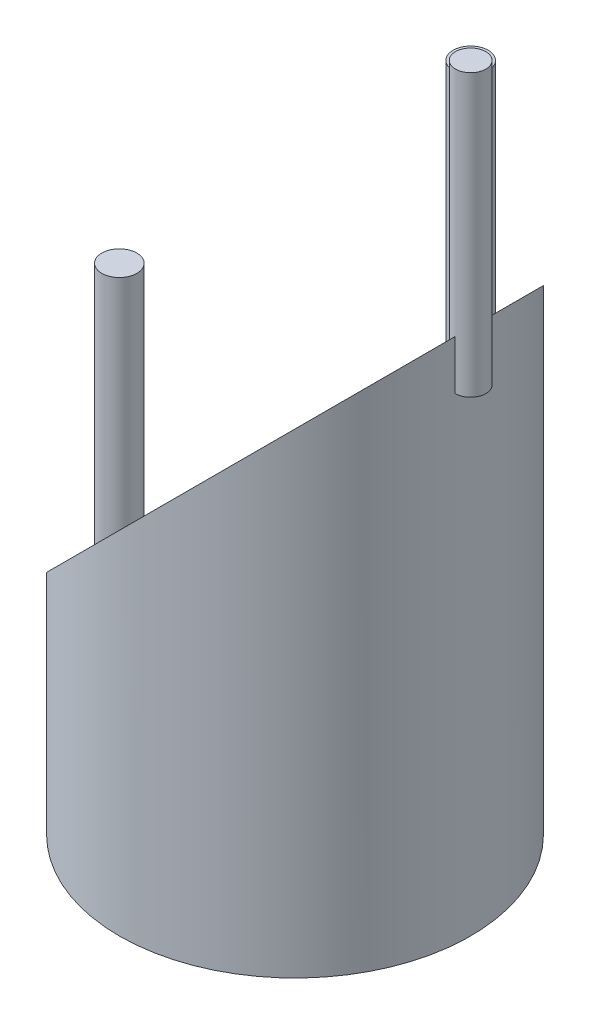
ISO-10303-21;
HEADER;
FILE_DESCRIPTION(('STEP AP214'),'2;1');
FILE_NAME('part.step','',(''),(''),'','','');
FILE_SCHEMA(('AUTOMOTIVE_DESIGN { 1 0 10303 214 1 1 1 1 }'));
ENDSEC;
DATA;
#1=APPLICATION_CONTEXT('core data for automotive mechanical design processes');
#2=APPLICATION_PROTOCOL_DEFINITION('international standard','automotive_design',2000,#1);
#3=PRODUCT_CONTEXT('',#1,'mechanical');
#4=PRODUCT('Part','Part','',(#3));
#5=PRODUCT_RELATED_PRODUCT_CATEGORY('part','',(#4));
#6=PRODUCT_DEFINITION_FORMATION('','',#4);
#7=PRODUCT_DEFINITION_CONTEXT('part definition',#1,'design');
#8=PRODUCT_DEFINITION('design','',#6,#7);
#9=PRODUCT_DEFINITION_SHAPE('','',#8);
#10=(LENGTH_UNIT() NAMED_UNIT(*) SI_UNIT(.MILLI.,.METRE.));
#11=(NAMED_UNIT(*) PLANE_ANGLE_UNIT() SI_UNIT($,.RADIAN.));
#12=(NAMED_UNIT(*) SI_UNIT($,.STERADIAN.) SOLID_ANGLE_UNIT());
#13=UNCERTAINTY_MEASURE_WITH_UNIT(LENGTH_MEASURE(1.E-05),#10,'distance_accuracy_value','');
#14=(GEOMETRIC_REPRESENTATION_CONTEXT(3) GLOBAL_UNCERTAINTY_ASSIGNED_CONTEXT((#13)) GLOBAL_UNIT_ASSIGNED_CONTEXT((#10,
#11,#12)) REPRESENTATION_CONTEXT('',''));
#15=CARTESIAN_POINT('',(0.,0.,0.));
#16=DIRECTION('',(0.,0.,1.));
#17=DIRECTION('',(1.,0.,0.));
#18=AXIS2_PLACEMENT_3D('',#15,#16,#17);
#19=CARTESIAN_POINT('',(0.,67.9289321881346,0.));
#20=DIRECTION('',(0.,1.,0.));
#21=DIRECTION('',(0.,0.,1.));
#22=AXIS2_PLACEMENT_3D('',#19,#20,#21);
#23=PLANE('',#22);
#24=CARTESIAN_POINT('',(25.,67.9289321881346,0.));
#25=DIRECTION('',(0.,1.,0.));
#26=DIRECTION('',(0.,0.,1.));
#27=AXIS2_PLACEMENT_3D('',#24,#25,#26);
#28=CIRCLE('',#27,2.1565995521632);
#29=CARTESIAN_POINT('',(25.,67.9289321881346,2.15659955216319));
#30=VERTEX_POINT('',#29);
#31=EDGE_CURVE('E50',#30,#30,#28,.T.);
#32=ORIENTED_EDGE('',*,*,#31,.F.);
#33=EDGE_LOOP('',(#32));
#34=FACE_BOUND('',#33,.T.);
#35=ADVANCED_FACE('F44',(#34),#23,.F.);
#36=CARTESIAN_POINT('',(0.,107.928932188135,0.));
#37=DIRECTION('',(0.,1.,0.));
#38=DIRECTION('',(0.,0.,1.));
#39=AXIS2_PLACEMENT_3D('',#36,#37,#38);
#40=PLANE('',#39);
#41=CARTESIAN_POINT('',(25.,107.928932188135,0.));
#42=DIRECTION('',(0.,1.,0.));
#43=DIRECTION('',(0.,0.,1.));
#44=AXIS2_PLACEMENT_3D('',#41,#42,#43);
#45=CIRCLE('',#44,2.1565995521632);
#46=CARTESIAN_POINT('',(25.,107.928932188135,2.15659955216319));
#47=VERTEX_POINT('',#46);
#48=EDGE_CURVE('E12',#47,#47,#45,.T.);
#49=ORIENTED_EDGE('',*,*,#48,.T.);
#50=EDGE_LOOP('',(#49));
#51=FACE_BOUND('',#50,.T.);
#52=ADVANCED_FACE('F60',(#51),#40,.T.);
#53=CARTESIAN_POINT('',(25.,67.9289321881346,0.));
#54=DIRECTION('',(0.,1.,0.));
#55=DIRECTION('',(0.,0.,1.));
#56=AXIS2_PLACEMENT_3D('',#53,#54,#55);
#57=CYLINDRICAL_SURFACE('',#56,2.1565995521632);
#58=ORIENTED_EDGE('',*,*,#31,.T.);
#59=EDGE_LOOP('',(#58));
#60=FACE_BOUND('',#59,.T.);
#61=ORIENTED_EDGE('',*,*,#48,.F.);
#62=EDGE_LOOP('',(#61));
#63=FACE_BOUND('',#62,.T.);
#64=ADVANCED_FACE('F56',(#60,#63),#57,.T.);
#65=CLOSED_SHELL('',(#35,#52,#64));
#66=MANIFOLD_SOLID_BREP('B2',#65);
#67=CARTESIAN_POINT('',(0.,42.9289321881346,0.));
#68=DIRECTION('',(0.,1.,0.));
#69=DIRECTION('',(0.,0.,1.));
#70=AXIS2_PLACEMENT_3D('',#67,#68,#69);
#71=PLANE('',#70);
#72=CARTESIAN_POINT('',(0.,42.9289321881345,-25.));
#73=DIRECTION('',(0.,1.,0.));
#74=DIRECTION('',(0.,0.,1.));
#75=AXIS2_PLACEMENT_3D('',#72,#73,#74);
#76=CIRCLE('',#75,2.5);
#77=CARTESIAN_POINT('',(0.,42.9289321881345,-22.5));
#78=VERTEX_POINT('',#77);
#79=EDGE_CURVE('E98',#78,#78,#76,.T.);
#80=ORIENTED_EDGE('',*,*,#79,.F.);
#81=EDGE_LOOP('',(#80));
#82=FACE_BOUND('',#81,.T.);
#83=ADVANCED_FACE('F92',(#82),#71,.F.);
#84=CARTESIAN_POINT('',(0.,82.9289321881346,0.));
#85=DIRECTION('',(0.,1.,0.));
#86=DIRECTION('',(0.,0.,1.));
#87=AXIS2_PLACEMENT_3D('',#84,#85,#86);
#88=PLANE('',#87);
#89=CARTESIAN_POINT('',(0.,82.9289321881346,-25.));
#90=DIRECTION('',(0.,1.,0.));
#91=DIRECTION('',(0.,0.,1.));
#92=AXIS2_PLACEMENT_3D('',#89,#90,#91);
#93=CIRCLE('',#92,2.5);
#94=CARTESIAN_POINT('',(0.,82.9289321881346,-22.5));
#95=VERTEX_POINT('',#94);
#96=EDGE_CURVE('E43',#95,#95,#93,.T.);
#97=ORIENTED_EDGE('',*,*,#96,.T.);
#98=EDGE_LOOP('',(#97));
#99=FACE_BOUND('',#98,.T.);
#100=ADVANCED_FACE('F108',(#99),#88,.T.);
#101=CARTESIAN_POINT('',(0.,42.9289321881345,-25.));
#102=DIRECTION('',(0.,1.,0.));
#103=DIRECTION('',(0.,0.,1.));
#104=AXIS2_PLACEMENT_3D('',#101,#102,#103);
#105=CYLINDRICAL_SURFACE('',#104,2.5);
#106=ORIENTED_EDGE('',*,*,#79,.T.);
#107=EDGE_LOOP('',(#106));
#108=FACE_BOUND('',#107,.T.);
#109=ORIENTED_EDGE('',*,*,#96,.F.);
#110=EDGE_LOOP('',(#109));
#111=FACE_BOUND('',#110,.T.);
#112=ADVANCED_FACE('F104',(#108,#111),#105,.T.);
#113=CLOSED_SHELL('',(#83,#100,#112));
#114=MANIFOLD_SOLID_BREP('B7_NOT_SHOWN',#113);
#115=CARTESIAN_POINT('',(0.,17.9289321881344,0.));
#116=DIRECTION('',(0.,1.,0.));
#117=DIRECTION('',(0.,0.,1.));
#118=AXIS2_PLACEMENT_3D('',#115,#116,#117);
#119=PLANE('',#118);
#120=CARTESIAN_POINT('',(-25.,17.9289321881344,0.));
#121=DIRECTION('',(0.,1.,0.));
#122=DIRECTION('',(0.,0.,1.));
#123=AXIS2_PLACEMENT_3D('',#120,#121,#122);
#124=CIRCLE('',#123,2.5);
#125=CARTESIAN_POINT('',(-25.,17.9289321881344,2.5));
#126=VERTEX_POINT('',#125);
#127=EDGE_CURVE('E145',#126,#126,#124,.T.);
#128=ORIENTED_EDGE('',*,*,#127,.F.);
#129=EDGE_LOOP('',(#128));
#130=FACE_BOUND('',#129,.T.);
#131=ADVANCED_FACE('F139',(#130),#119,.F.);
#132=CARTESIAN_POINT('',(0.,57.9289321881344,0.));
#133=DIRECTION('',(0.,1.,0.));
#134=DIRECTION('',(0.,0.,1.));
#135=AXIS2_PLACEMENT_3D('',#132,#133,#134);
#136=PLANE('',#135);
#137=CARTESIAN_POINT('',(-25.,57.9289321881344,0.));
#138=DIRECTION('',(0.,1.,0.));
#139=DIRECTION('',(0.,0.,1.));
#140=AXIS2_PLACEMENT_3D('',#137,#138,#139);
#141=CIRCLE('',#140,2.5);
#142=CARTESIAN_POINT('',(-25.,57.9289321881344,2.5));
#143=VERTEX_POINT('',#142);
#144=EDGE_CURVE('E91',#143,#143,#141,.T.);
#145=ORIENTED_EDGE('',*,*,#144,.T.);
#146=EDGE_LOOP('',(#145));
#147=FACE_BOUND('',#146,.T.);
#148=ADVANCED_FACE('F155',(#147),#136,.T.);
#149=CARTESIAN_POINT('',(-25.,17.9289321881344,0.));
#150=DIRECTION('',(0.,1.,0.));
#151=DIRECTION('',(0.,0.,1.));
#152=AXIS2_PLACEMENT_3D('',#149,#150,#151);
#153=CYLINDRICAL_SURFACE('',#152,2.5);
#154=ORIENTED_EDGE('',*,*,#127,.T.);
#155=EDGE_LOOP('',(#154));
#156=FACE_BOUND('',#155,.T.);
#157=ORIENTED_EDGE('',*,*,#144,.F.);
#158=EDGE_LOOP('',(#157));
#159=FACE_BOUND('',#158,.T.);
#160=ADVANCED_FACE('F151',(#156,#159),#153,.T.);
#161=CLOSED_SHELL('',(#131,#148,#160));
#162=MANIFOLD_SOLID_BREP('B38_NOT_SHOWN',#161);
#163=CARTESIAN_POINT('',(0.,135.355339059327,0.));
#164=DIRECTION('',(0.,-1.,0.));
#165=DIRECTION('',(0.,0.,-1.));
#166=AXIS2_PLACEMENT_3D('',#163,#164,#165);
#167=CYLINDRICAL_SURFACE('',#166,25.);
#168=CARTESIAN_POINT('',(0.,0.,0.));
#169=DIRECTION('',(0.,1.,0.));
#170=DIRECTION('',(0.,0.,1.));
#171=AXIS2_PLACEMENT_3D('',#168,#169,#170);
#172=CIRCLE('',#171,25.);
#173=CARTESIAN_POINT('',(0.,0.,25.));
#174=VERTEX_POINT('',#173);
#175=EDGE_CURVE('E186',#174,#174,#172,.T.);
#176=ORIENTED_EDGE('',*,*,#175,.T.);
#177=EDGE_LOOP('',(#176));
#178=FACE_BOUND('',#177,.T.);
#179=CARTESIAN_POINT('',(0.,50.,0.));
#180=DIRECTION('',(-0.707106781186549,0.707106781186546,0.));
#181=DIRECTION('',(-0.707106781186546,-0.707106781186549,0.));
#182=AXIS2_PLACEMENT_3D('',#179,#180,#181);
#183=ELLIPSE('',#182,35.3553390593274,25.);
#184=CARTESIAN_POINT('',(-25.,24.9999999999999,0.));
#185=VERTEX_POINT('',#184);
#186=EDGE_CURVE('E138',#185,#185,#183,.T.);
#187=ORIENTED_EDGE('',*,*,#186,.F.);
#188=EDGE_LOOP('',(#187));
#189=FACE_BOUND('',#188,.T.);
#190=ADVANCED_FACE('F179',(#178,#189),#167,.T.);
#191=CARTESIAN_POINT('',(0.,0.,0.));
#192=DIRECTION('',(0.,1.,0.));
#193=DIRECTION('',(0.,0.,1.));
#194=AXIS2_PLACEMENT_3D('',#191,#192,#193);
#195=PLANE('',#194);
#196=ORIENTED_EDGE('',*,*,#175,.F.);
#197=EDGE_LOOP('',(#196));
#198=FACE_BOUND('',#197,.T.);
#199=ADVANCED_FACE('F194',(#198),#195,.F.);
#200=CARTESIAN_POINT('',(-25.,24.9999999999999,0.));
#201=DIRECTION('',(-0.707106781186549,0.707106781186546,0.));
#202=DIRECTION('',(-0.707106781186546,-0.707106781186549,0.));
#203=AXIS2_PLACEMENT_3D('',#200,#201,#202);
#204=PLANE('',#203);
#205=ORIENTED_EDGE('',*,*,#186,.T.);
#206=EDGE_LOOP('',(#205));
#207=FACE_BOUND('',#206,.T.);
#208=ADVANCED_FACE('F181',(#207),#204,.T.);
#209=CLOSED_SHELL('',(#190,#199,#208));
#210=MANIFOLD_SOLID_BREP('B86',#209);
#211=ADVANCED_BREP_SHAPE_REPRESENTATION('',(#18,#66,#114,#162,#210),#14);
#212=SHAPE_DEFINITION_REPRESENTATION(#9,#211);
ENDSEC;
END-ISO-10303-21;
